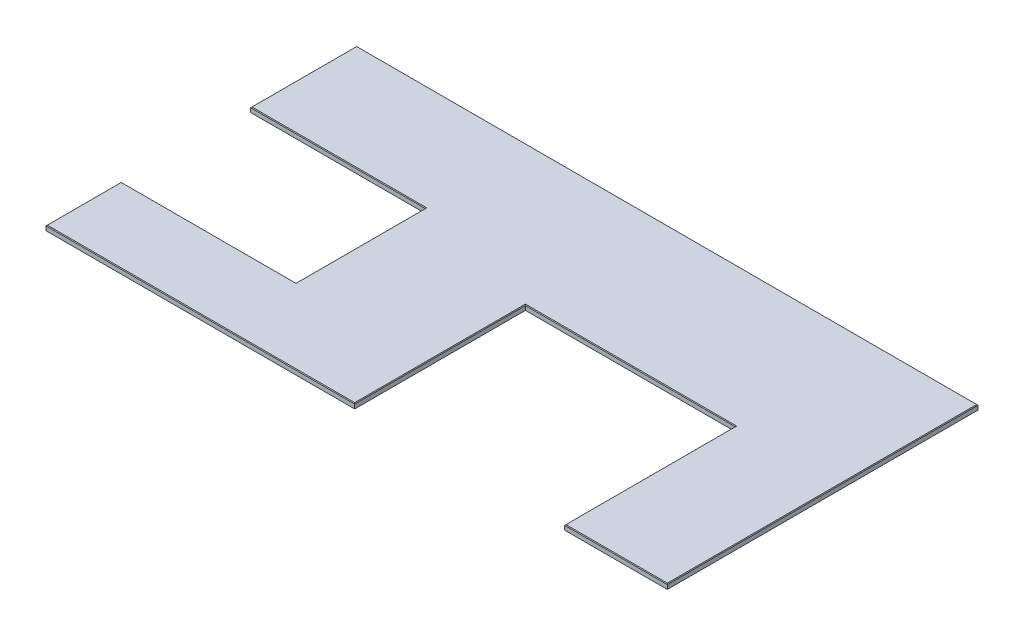
ISO-10303-21;
HEADER;
FILE_DESCRIPTION(('STEP AP214'),'2;1');
FILE_NAME('part.step','',(''),(''),'','','');
FILE_SCHEMA(('AUTOMOTIVE_DESIGN { 1 0 10303 214 1 1 1 1 }'));
ENDSEC;
DATA;
#1=APPLICATION_CONTEXT('core data for automotive mechanical design processes');
#2=APPLICATION_PROTOCOL_DEFINITION('international standard','automotive_design',2000,#1);
#3=PRODUCT_CONTEXT('',#1,'mechanical');
#4=PRODUCT('Part','Part','',(#3));
#5=PRODUCT_RELATED_PRODUCT_CATEGORY('part','',(#4));
#6=PRODUCT_DEFINITION_FORMATION('','',#4);
#7=PRODUCT_DEFINITION_CONTEXT('part definition',#1,'design');
#8=PRODUCT_DEFINITION('design','',#6,#7);
#9=PRODUCT_DEFINITION_SHAPE('','',#8);
#10=(LENGTH_UNIT() NAMED_UNIT(*) SI_UNIT(.MILLI.,.METRE.));
#11=(NAMED_UNIT(*) PLANE_ANGLE_UNIT() SI_UNIT($,.RADIAN.));
#12=(NAMED_UNIT(*) SI_UNIT($,.STERADIAN.) SOLID_ANGLE_UNIT());
#13=UNCERTAINTY_MEASURE_WITH_UNIT(LENGTH_MEASURE(1.E-05),#10,'distance_accuracy_value','');
#14=(GEOMETRIC_REPRESENTATION_CONTEXT(3) GLOBAL_UNCERTAINTY_ASSIGNED_CONTEXT((#13)) GLOBAL_UNIT_ASSIGNED_CONTEXT((#10,
#11,#12)) REPRESENTATION_CONTEXT('',''));
#15=CARTESIAN_POINT('',(0.,0.,0.));
#16=DIRECTION('',(0.,0.,1.));
#17=DIRECTION('',(1.,0.,0.));
#18=AXIS2_PLACEMENT_3D('',#15,#16,#17);
#19=CARTESIAN_POINT('',(0.,-19.05,0.));
#20=DIRECTION('',(0.,0.,1.));
#21=DIRECTION('',(1.,0.,0.));
#22=AXIS2_PLACEMENT_3D('',#19,#20,#21);
#23=PLANE('',#22);
#24=DIRECTION('',(0.,1.,0.));
#25=VECTOR('',#24,1.);
#26=CARTESIAN_POINT('',(1211.5165,-19.05,0.));
#27=LINE('',#26,#25);
#28=CARTESIAN_POINT('',(1211.5165,-19.05,0.));
#29=VERTEX_POINT('',#28);
#30=CARTESIAN_POINT('',(1211.5165,-2.53999999999999,0.));
#31=VERTEX_POINT('',#30);
#32=EDGE_CURVE('E166',#29,#31,#27,.T.);
#33=ORIENTED_EDGE('',*,*,#32,.T.);
#34=DIRECTION('',(-1.,0.,0.));
#35=VECTOR('',#34,1.);
#36=CARTESIAN_POINT('',(0.,-2.53999999999999,0.));
#37=LINE('',#36,#35);
#38=CARTESIAN_POINT('',(0.,-2.53999999999999,0.));
#39=VERTEX_POINT('',#38);
#40=EDGE_CURVE('E11',#31,#39,#37,.T.);
#41=ORIENTED_EDGE('',*,*,#40,.T.);
#42=DIRECTION('',(0.,1.,0.));
#43=VECTOR('',#42,1.);
#44=CARTESIAN_POINT('',(0.,-19.05,0.));
#45=LINE('',#44,#43);
#46=CARTESIAN_POINT('',(0.,-19.05,0.));
#47=VERTEX_POINT('',#46);
#48=EDGE_CURVE('E188',#47,#39,#45,.T.);
#49=ORIENTED_EDGE('',*,*,#48,.F.);
#50=DIRECTION('',(1.,0.,0.));
#51=VECTOR('',#50,1.);
#52=CARTESIAN_POINT('',(0.,-19.05,0.));
#53=LINE('',#52,#51);
#54=EDGE_CURVE('E181',#47,#29,#53,.T.);
#55=ORIENTED_EDGE('',*,*,#54,.T.);
#56=EDGE_LOOP('',(#33,#41,#49,#55));
#57=FACE_BOUND('',#56,.T.);
#58=ADVANCED_FACE('F41',(#57),#23,.T.);
#59=CARTESIAN_POINT('',(1.13148179390222E-13,-19.05,-295.275));
#60=DIRECTION('',(-1.,0.,0.));
#61=DIRECTION('',(0.,0.,1.));
#62=AXIS2_PLACEMENT_3D('',#59,#60,#61);
#63=PLANE('',#62);
#64=ORIENTED_EDGE('',*,*,#48,.T.);
#65=DIRECTION('',(0.,0.,-1.));
#66=VECTOR('',#65,1.);
#67=CARTESIAN_POINT('',(1.13148179390222E-13,-2.53999999999999,-295.275));
#68=LINE('',#67,#66);
#69=CARTESIAN_POINT('',(1.13148179390222E-13,-2.53999999999999,-295.275));
#70=VERTEX_POINT('',#69);
#71=EDGE_CURVE('E272',#39,#70,#68,.T.);
#72=ORIENTED_EDGE('',*,*,#71,.T.);
#73=DIRECTION('',(0.,1.,0.));
#74=VECTOR('',#73,1.);
#75=CARTESIAN_POINT('',(1.13148179390222E-13,-19.05,-295.275));
#76=LINE('',#75,#74);
#77=CARTESIAN_POINT('',(1.13148179390222E-13,-19.05,-295.275));
#78=VERTEX_POINT('',#77);
#79=EDGE_CURVE('E221',#78,#70,#76,.T.);
#80=ORIENTED_EDGE('',*,*,#79,.F.);
#81=DIRECTION('',(0.,0.,1.));
#82=VECTOR('',#81,1.);
#83=CARTESIAN_POINT('',(1.13148179390222E-13,-19.05,-295.275));
#84=LINE('',#83,#82);
#85=EDGE_CURVE('E174',#78,#47,#84,.T.);
#86=ORIENTED_EDGE('',*,*,#85,.T.);
#87=EDGE_LOOP('',(#64,#72,#80,#86));
#88=FACE_BOUND('',#87,.T.);
#89=ADVANCED_FACE('F354',(#88),#63,.T.);
#90=CARTESIAN_POINT('',(1.13148179390222E-13,-19.05,-295.275));
#91=DIRECTION('',(0.,0.,-1.));
#92=DIRECTION('',(-1.,0.,0.));
#93=AXIS2_PLACEMENT_3D('',#90,#91,#92);
#94=PLANE('',#93);
#95=ORIENTED_EDGE('',*,*,#79,.T.);
#96=DIRECTION('',(1.,0.,0.));
#97=VECTOR('',#96,1.);
#98=CARTESIAN_POINT('',(1.13148179390222E-13,-2.53999999999999,-295.275));
#99=LINE('',#98,#97);
#100=CARTESIAN_POINT('',(685.8,-2.53999999999999,-295.275));
#101=VERTEX_POINT('',#100);
#102=EDGE_CURVE('E275',#70,#101,#99,.T.);
#103=ORIENTED_EDGE('',*,*,#102,.T.);
#104=DIRECTION('',(0.,1.,0.));
#105=VECTOR('',#104,1.);
#106=CARTESIAN_POINT('',(685.8,-19.05,-295.275));
#107=LINE('',#106,#105);
#108=CARTESIAN_POINT('',(685.8,-19.05,-295.275));
#109=VERTEX_POINT('',#108);
#110=EDGE_CURVE('E224',#109,#101,#107,.T.);
#111=ORIENTED_EDGE('',*,*,#110,.F.);
#112=DIRECTION('',(-1.,0.,0.));
#113=VECTOR('',#112,1.);
#114=CARTESIAN_POINT('',(1.13148179390222E-13,-19.05,-295.275));
#115=LINE('',#114,#113);
#116=EDGE_CURVE('E215',#109,#78,#115,.T.);
#117=ORIENTED_EDGE('',*,*,#116,.T.);
#118=EDGE_LOOP('',(#95,#103,#111,#117));
#119=FACE_BOUND('',#118,.T.);
#120=ADVANCED_FACE('F365',(#119),#94,.T.);
#121=CARTESIAN_POINT('',(685.8,-19.05,-803.275));
#122=DIRECTION('',(-1.,0.,0.));
#123=DIRECTION('',(0.,0.,1.));
#124=AXIS2_PLACEMENT_3D('',#121,#122,#123);
#125=PLANE('',#124);
#126=ORIENTED_EDGE('',*,*,#110,.T.);
#127=DIRECTION('',(0.,0.,-1.));
#128=VECTOR('',#127,1.);
#129=CARTESIAN_POINT('',(685.8,-2.53999999999999,-803.275));
#130=LINE('',#129,#128);
#131=CARTESIAN_POINT('',(685.8,-2.53999999999999,-803.275));
#132=VERTEX_POINT('',#131);
#133=EDGE_CURVE('E277',#101,#132,#130,.T.);
#134=ORIENTED_EDGE('',*,*,#133,.T.);
#135=DIRECTION('',(0.,1.,0.));
#136=VECTOR('',#135,1.);
#137=CARTESIAN_POINT('',(685.8,-19.05,-803.275));
#138=LINE('',#137,#136);
#139=CARTESIAN_POINT('',(685.8,-19.05,-803.275));
#140=VERTEX_POINT('',#139);
#141=EDGE_CURVE('E227',#140,#132,#138,.T.);
#142=ORIENTED_EDGE('',*,*,#141,.F.);
#143=DIRECTION('',(0.,0.,1.));
#144=VECTOR('',#143,1.);
#145=CARTESIAN_POINT('',(685.8,-19.05,-803.275));
#146=LINE('',#145,#144);
#147=EDGE_CURVE('E212',#140,#109,#146,.T.);
#148=ORIENTED_EDGE('',*,*,#147,.T.);
#149=EDGE_LOOP('',(#126,#134,#142,#148));
#150=FACE_BOUND('',#149,.T.);
#151=ADVANCED_FACE('F369',(#150),#125,.T.);
#152=CARTESIAN_POINT('',(0.,-19.05,-803.275));
#153=DIRECTION('',(0.,0.,1.));
#154=DIRECTION('',(1.,0.,0.));
#155=AXIS2_PLACEMENT_3D('',#152,#153,#154);
#156=PLANE('',#155);
#157=ORIENTED_EDGE('',*,*,#141,.T.);
#158=DIRECTION('',(-1.,0.,0.));
#159=VECTOR('',#158,1.);
#160=CARTESIAN_POINT('',(0.,-2.53999999999999,-803.275));
#161=LINE('',#160,#159);
#162=CARTESIAN_POINT('',(0.,-2.53999999999999,-803.275));
#163=VERTEX_POINT('',#162);
#164=EDGE_CURVE('E279',#132,#163,#161,.T.);
#165=ORIENTED_EDGE('',*,*,#164,.T.);
#166=DIRECTION('',(0.,1.,0.));
#167=VECTOR('',#166,1.);
#168=CARTESIAN_POINT('',(0.,-19.05,-803.275));
#169=LINE('',#168,#167);
#170=CARTESIAN_POINT('',(0.,-19.05,-803.275));
#171=VERTEX_POINT('',#170);
#172=EDGE_CURVE('E230',#171,#163,#169,.T.);
#173=ORIENTED_EDGE('',*,*,#172,.F.);
#174=DIRECTION('',(1.,0.,0.));
#175=VECTOR('',#174,1.);
#176=CARTESIAN_POINT('',(0.,-19.05,-803.275));
#177=LINE('',#176,#175);
#178=EDGE_CURVE('E209',#171,#140,#177,.T.);
#179=ORIENTED_EDGE('',*,*,#178,.T.);
#180=EDGE_LOOP('',(#157,#165,#173,#179));
#181=FACE_BOUND('',#180,.T.);
#182=ADVANCED_FACE('F381',(#181),#156,.T.);
#183=CARTESIAN_POINT('',(-2.29534139493609E-13,-19.05,-1219.2));
#184=DIRECTION('',(-1.,0.,0.));
#185=DIRECTION('',(0.,0.,1.));
#186=AXIS2_PLACEMENT_3D('',#183,#184,#185);
#187=PLANE('',#186);
#188=ORIENTED_EDGE('',*,*,#172,.T.);
#189=DIRECTION('',(0.,0.,-1.));
#190=VECTOR('',#189,1.);
#191=CARTESIAN_POINT('',(-2.29534139493609E-13,-2.53999999999999,-1219.2));
#192=LINE('',#191,#190);
#193=CARTESIAN_POINT('',(-2.29534139493609E-13,-2.53999999999999,-1219.2));
#194=VERTEX_POINT('',#193);
#195=EDGE_CURVE('E281',#163,#194,#192,.T.);
#196=ORIENTED_EDGE('',*,*,#195,.T.);
#197=DIRECTION('',(0.,1.,0.));
#198=VECTOR('',#197,1.);
#199=CARTESIAN_POINT('',(-2.29534139493609E-13,-19.05,-1219.2));
#200=LINE('',#199,#198);
#201=CARTESIAN_POINT('',(-2.29534139493609E-13,-19.05,-1219.2));
#202=VERTEX_POINT('',#201);
#203=EDGE_CURVE('E233',#202,#194,#200,.T.);
#204=ORIENTED_EDGE('',*,*,#203,.F.);
#205=DIRECTION('',(0.,0.,1.));
#206=VECTOR('',#205,1.);
#207=CARTESIAN_POINT('',(-2.29534139493609E-13,-19.05,-1219.2));
#208=LINE('',#207,#206);
#209=EDGE_CURVE('E206',#202,#171,#208,.T.);
#210=ORIENTED_EDGE('',*,*,#209,.T.);
#211=EDGE_LOOP('',(#188,#196,#204,#210));
#212=FACE_BOUND('',#211,.T.);
#213=ADVANCED_FACE('F385',(#212),#187,.T.);
#214=CARTESIAN_POINT('',(2438.4,-19.05,-1219.2));
#215=DIRECTION('',(0.,0.,-1.));
#216=DIRECTION('',(-1.,0.,0.));
#217=AXIS2_PLACEMENT_3D('',#214,#215,#216);
#218=PLANE('',#217);
#219=ORIENTED_EDGE('',*,*,#203,.T.);
#220=DIRECTION('',(1.,0.,0.));
#221=VECTOR('',#220,1.);
#222=CARTESIAN_POINT('',(2438.4,-2.53999999999999,-1219.2));
#223=LINE('',#222,#221);
#224=CARTESIAN_POINT('',(2438.4,-2.53999999999999,-1219.2));
#225=VERTEX_POINT('',#224);
#226=EDGE_CURVE('E283',#194,#225,#223,.T.);
#227=ORIENTED_EDGE('',*,*,#226,.T.);
#228=DIRECTION('',(0.,1.,0.));
#229=VECTOR('',#228,1.);
#230=CARTESIAN_POINT('',(2438.4,-19.05,-1219.2));
#231=LINE('',#230,#229);
#232=CARTESIAN_POINT('',(2438.4,-19.05,-1219.2));
#233=VERTEX_POINT('',#232);
#234=EDGE_CURVE('E236',#233,#225,#231,.T.);
#235=ORIENTED_EDGE('',*,*,#234,.F.);
#236=DIRECTION('',(-1.,0.,0.));
#237=VECTOR('',#236,1.);
#238=CARTESIAN_POINT('',(2438.4,-19.05,-1219.2));
#239=LINE('',#238,#237);
#240=EDGE_CURVE('E203',#233,#202,#239,.T.);
#241=ORIENTED_EDGE('',*,*,#240,.T.);
#242=EDGE_LOOP('',(#219,#227,#235,#241));
#243=FACE_BOUND('',#242,.T.);
#244=ADVANCED_FACE('F394',(#243),#218,.T.);
#245=CARTESIAN_POINT('',(2438.4,-19.05,0.));
#246=DIRECTION('',(1.,0.,0.));
#247=DIRECTION('',(0.,0.,-1.));
#248=AXIS2_PLACEMENT_3D('',#245,#246,#247);
#249=PLANE('',#248);
#250=ORIENTED_EDGE('',*,*,#234,.T.);
#251=DIRECTION('',(0.,0.,1.));
#252=VECTOR('',#251,1.);
#253=CARTESIAN_POINT('',(2438.4,-2.53999999999999,0.));
#254=LINE('',#253,#252);
#255=CARTESIAN_POINT('',(2438.4,-2.53999999999999,0.));
#256=VERTEX_POINT('',#255);
#257=EDGE_CURVE('E285',#225,#256,#254,.T.);
#258=ORIENTED_EDGE('',*,*,#257,.T.);
#259=DIRECTION('',(0.,1.,0.));
#260=VECTOR('',#259,1.);
#261=CARTESIAN_POINT('',(2438.4,-19.05,0.));
#262=LINE('',#261,#260);
#263=CARTESIAN_POINT('',(2438.4,-19.05,0.));
#264=VERTEX_POINT('',#263);
#265=EDGE_CURVE('E239',#264,#256,#262,.T.);
#266=ORIENTED_EDGE('',*,*,#265,.F.);
#267=DIRECTION('',(0.,0.,-1.));
#268=VECTOR('',#267,1.);
#269=CARTESIAN_POINT('',(2438.4,-19.05,0.));
#270=LINE('',#269,#268);
#271=EDGE_CURVE('E200',#264,#233,#270,.T.);
#272=ORIENTED_EDGE('',*,*,#271,.T.);
#273=EDGE_LOOP('',(#250,#258,#266,#272));
#274=FACE_BOUND('',#273,.T.);
#275=ADVANCED_FACE('F397',(#274),#249,.T.);
#276=CARTESIAN_POINT('',(2035.429,-19.05,0.));
#277=DIRECTION('',(0.,0.,1.));
#278=DIRECTION('',(1.,0.,0.));
#279=AXIS2_PLACEMENT_3D('',#276,#277,#278);
#280=PLANE('',#279);
#281=ORIENTED_EDGE('',*,*,#265,.T.);
#282=DIRECTION('',(-1.,0.,0.));
#283=VECTOR('',#282,1.);
#284=CARTESIAN_POINT('',(2035.429,-2.53999999999999,0.));
#285=LINE('',#284,#283);
#286=CARTESIAN_POINT('',(2035.429,-2.53999999999999,0.));
#287=VERTEX_POINT('',#286);
#288=EDGE_CURVE('E287',#256,#287,#285,.T.);
#289=ORIENTED_EDGE('',*,*,#288,.T.);
#290=DIRECTION('',(0.,1.,0.));
#291=VECTOR('',#290,1.);
#292=CARTESIAN_POINT('',(2035.429,-19.05,0.));
#293=LINE('',#292,#291);
#294=CARTESIAN_POINT('',(2035.429,-19.05,0.));
#295=VERTEX_POINT('',#294);
#296=EDGE_CURVE('E242',#295,#287,#293,.T.);
#297=ORIENTED_EDGE('',*,*,#296,.F.);
#298=DIRECTION('',(1.,0.,0.));
#299=VECTOR('',#298,1.);
#300=CARTESIAN_POINT('',(2035.429,-19.05,0.));
#301=LINE('',#300,#299);
#302=EDGE_CURVE('E197',#295,#264,#301,.T.);
#303=ORIENTED_EDGE('',*,*,#302,.T.);
#304=EDGE_LOOP('',(#281,#289,#297,#303));
#305=FACE_BOUND('',#304,.T.);
#306=ADVANCED_FACE('F401',(#305),#280,.T.);
#307=CARTESIAN_POINT('',(2035.429,-19.05,-669.925));
#308=DIRECTION('',(-1.,0.,0.));
#309=DIRECTION('',(0.,0.,1.));
#310=AXIS2_PLACEMENT_3D('',#307,#308,#309);
#311=PLANE('',#310);
#312=ORIENTED_EDGE('',*,*,#296,.T.);
#313=DIRECTION('',(0.,0.,-1.));
#314=VECTOR('',#313,1.);
#315=CARTESIAN_POINT('',(2035.429,-2.53999999999999,-669.925));
#316=LINE('',#315,#314);
#317=CARTESIAN_POINT('',(2035.429,-2.53999999999999,-669.925));
#318=VERTEX_POINT('',#317);
#319=EDGE_CURVE('E289',#287,#318,#316,.T.);
#320=ORIENTED_EDGE('',*,*,#319,.T.);
#321=DIRECTION('',(0.,1.,0.));
#322=VECTOR('',#321,1.);
#323=CARTESIAN_POINT('',(2035.429,-19.05,-669.925));
#324=LINE('',#323,#322);
#325=CARTESIAN_POINT('',(2035.429,-19.05,-669.925));
#326=VERTEX_POINT('',#325);
#327=EDGE_CURVE('E245',#326,#318,#324,.T.);
#328=ORIENTED_EDGE('',*,*,#327,.F.);
#329=DIRECTION('',(0.,0.,1.));
#330=VECTOR('',#329,1.);
#331=CARTESIAN_POINT('',(2035.429,-19.05,-669.925));
#332=LINE('',#331,#330);
#333=EDGE_CURVE('E194',#326,#295,#332,.T.);
#334=ORIENTED_EDGE('',*,*,#333,.T.);
#335=EDGE_LOOP('',(#312,#320,#328,#334));
#336=FACE_BOUND('',#335,.T.);
#337=ADVANCED_FACE('F403',(#336),#311,.T.);
#338=CARTESIAN_POINT('',(1211.5165,-19.05,-669.925));
#339=DIRECTION('',(0.,0.,1.));
#340=DIRECTION('',(1.,0.,0.));
#341=AXIS2_PLACEMENT_3D('',#338,#339,#340);
#342=PLANE('',#341);
#343=ORIENTED_EDGE('',*,*,#327,.T.);
#344=DIRECTION('',(-1.,0.,0.));
#345=VECTOR('',#344,1.);
#346=CARTESIAN_POINT('',(1211.5165,-2.53999999999999,-669.925));
#347=LINE('',#346,#345);
#348=CARTESIAN_POINT('',(1211.5165,-2.53999999999999,-669.925));
#349=VERTEX_POINT('',#348);
#350=EDGE_CURVE('E66',#318,#349,#347,.T.);
#351=ORIENTED_EDGE('',*,*,#350,.T.);
#352=DIRECTION('',(0.,1.,0.));
#353=VECTOR('',#352,1.);
#354=CARTESIAN_POINT('',(1211.5165,-19.05,-669.925));
#355=LINE('',#354,#353);
#356=CARTESIAN_POINT('',(1211.5165,-19.05,-669.925));
#357=VERTEX_POINT('',#356);
#358=EDGE_CURVE('E173',#357,#349,#355,.T.);
#359=ORIENTED_EDGE('',*,*,#358,.F.);
#360=DIRECTION('',(1.,0.,0.));
#361=VECTOR('',#360,1.);
#362=CARTESIAN_POINT('',(1211.5165,-19.05,-669.925));
#363=LINE('',#362,#361);
#364=EDGE_CURVE('E185',#357,#326,#363,.T.);
#365=ORIENTED_EDGE('',*,*,#364,.T.);
#366=EDGE_LOOP('',(#343,#351,#359,#365));
#367=FACE_BOUND('',#366,.T.);
#368=ADVANCED_FACE('F404',(#367),#342,.T.);
#369=CARTESIAN_POINT('',(1211.5165,-19.05,0.));
#370=DIRECTION('',(1.,0.,0.));
#371=DIRECTION('',(0.,0.,-1.));
#372=AXIS2_PLACEMENT_3D('',#369,#370,#371);
#373=PLANE('',#372);
#374=ORIENTED_EDGE('',*,*,#358,.T.);
#375=DIRECTION('',(0.,0.,1.));
#376=VECTOR('',#375,1.);
#377=CARTESIAN_POINT('',(1211.5165,-2.53999999999999,0.));
#378=LINE('',#377,#376);
#379=EDGE_CURVE('E51',#349,#31,#378,.T.);
#380=ORIENTED_EDGE('',*,*,#379,.T.);
#381=ORIENTED_EDGE('',*,*,#32,.F.);
#382=DIRECTION('',(0.,0.,-1.));
#383=VECTOR('',#382,1.);
#384=CARTESIAN_POINT('',(1211.5165,-19.05,0.));
#385=LINE('',#384,#383);
#386=EDGE_CURVE('E169',#29,#357,#385,.T.);
#387=ORIENTED_EDGE('',*,*,#386,.T.);
#388=EDGE_LOOP('',(#374,#380,#381,#387));
#389=FACE_BOUND('',#388,.T.);
#390=ADVANCED_FACE('F168',(#389),#373,.T.);
#391=CARTESIAN_POINT('',(0.,-19.05,0.));
#392=DIRECTION('',(0.,1.,0.));
#393=DIRECTION('',(0.,0.,1.));
#394=AXIS2_PLACEMENT_3D('',#391,#392,#393);
#395=PLANE('',#394);
#396=ORIENTED_EDGE('',*,*,#54,.F.);
#397=ORIENTED_EDGE('',*,*,#85,.F.);
#398=ORIENTED_EDGE('',*,*,#116,.F.);
#399=ORIENTED_EDGE('',*,*,#147,.F.);
#400=ORIENTED_EDGE('',*,*,#178,.F.);
#401=ORIENTED_EDGE('',*,*,#209,.F.);
#402=ORIENTED_EDGE('',*,*,#240,.F.);
#403=ORIENTED_EDGE('',*,*,#271,.F.);
#404=ORIENTED_EDGE('',*,*,#302,.F.);
#405=ORIENTED_EDGE('',*,*,#333,.F.);
#406=ORIENTED_EDGE('',*,*,#364,.F.);
#407=ORIENTED_EDGE('',*,*,#386,.F.);
#408=EDGE_LOOP('',(#396,#397,#398,#399,#400,#401,#402,#403,#404,#405,#406,#407));
#409=FACE_BOUND('',#408,.T.);
#410=ADVANCED_FACE('F179',(#409),#395,.F.);
#411=CARTESIAN_POINT('',(0.,0.,0.));
#412=DIRECTION('',(0.,1.,0.));
#413=DIRECTION('',(0.,0.,1.));
#414=AXIS2_PLACEMENT_3D('',#411,#412,#413);
#415=PLANE('',#414);
#416=DIRECTION('',(-1.,0.,0.));
#417=VECTOR('',#416,1.);
#418=CARTESIAN_POINT('',(0.,0.,-292.735));
#419=LINE('',#418,#417);
#420=CARTESIAN_POINT('',(688.34,0.,-292.735));
#421=VERTEX_POINT('',#420);
#422=CARTESIAN_POINT('',(2.5400000000001,0.,-292.735));
#423=VERTEX_POINT('',#422);
#424=EDGE_CURVE('E267',#421,#423,#419,.T.);
#425=ORIENTED_EDGE('',*,*,#424,.T.);
#426=DIRECTION('',(0.,0.,1.));
#427=VECTOR('',#426,1.);
#428=CARTESIAN_POINT('',(2.53999999999999,0.,0.));
#429=LINE('',#428,#427);
#430=CARTESIAN_POINT('',(2.53999999999999,0.,-2.53999999999999));
#431=VERTEX_POINT('',#430);
#432=EDGE_CURVE('E269',#423,#431,#429,.T.);
#433=ORIENTED_EDGE('',*,*,#432,.T.);
#434=DIRECTION('',(1.,0.,0.));
#435=VECTOR('',#434,1.);
#436=CARTESIAN_POINT('',(0.,0.,-2.53999999999999));
#437=LINE('',#436,#435);
#438=CARTESIAN_POINT('',(1208.9765,0.,-2.53999999999999));
#439=VERTEX_POINT('',#438);
#440=EDGE_CURVE('E220',#431,#439,#437,.T.);
#441=ORIENTED_EDGE('',*,*,#440,.T.);
#442=DIRECTION('',(0.,0.,-1.));
#443=VECTOR('',#442,1.);
#444=CARTESIAN_POINT('',(1208.9765,0.,0.));
#445=LINE('',#444,#443);
#446=CARTESIAN_POINT('',(1208.9765,0.,-672.465));
#447=VERTEX_POINT('',#446);
#448=EDGE_CURVE('E249',#439,#447,#445,.T.);
#449=ORIENTED_EDGE('',*,*,#448,.T.);
#450=DIRECTION('',(1.,0.,0.));
#451=VECTOR('',#450,1.);
#452=CARTESIAN_POINT('',(0.,0.,-672.465));
#453=LINE('',#452,#451);
#454=CARTESIAN_POINT('',(2037.969,0.,-672.465));
#455=VERTEX_POINT('',#454);
#456=EDGE_CURVE('E251',#447,#455,#453,.T.);
#457=ORIENTED_EDGE('',*,*,#456,.T.);
#458=DIRECTION('',(0.,0.,1.));
#459=VECTOR('',#458,1.);
#460=CARTESIAN_POINT('',(2037.969,0.,0.));
#461=LINE('',#460,#459);
#462=CARTESIAN_POINT('',(2037.969,0.,-2.53999999999999));
#463=VERTEX_POINT('',#462);
#464=EDGE_CURVE('E253',#455,#463,#461,.T.);
#465=ORIENTED_EDGE('',*,*,#464,.T.);
#466=DIRECTION('',(1.,0.,0.));
#467=VECTOR('',#466,1.);
#468=CARTESIAN_POINT('',(0.,0.,-2.53999999999999));
#469=LINE('',#468,#467);
#470=CARTESIAN_POINT('',(2435.86,0.,-2.53999999999999));
#471=VERTEX_POINT('',#470);
#472=EDGE_CURVE('E255',#463,#471,#469,.T.);
#473=ORIENTED_EDGE('',*,*,#472,.T.);
#474=DIRECTION('',(0.,0.,-1.));
#475=VECTOR('',#474,1.);
#476=CARTESIAN_POINT('',(2435.86,0.,0.));
#477=LINE('',#476,#475);
#478=CARTESIAN_POINT('',(2435.86,0.,-1216.66));
#479=VERTEX_POINT('',#478);
#480=EDGE_CURVE('E257',#471,#479,#477,.T.);
#481=ORIENTED_EDGE('',*,*,#480,.T.);
#482=DIRECTION('',(-1.,0.,0.));
#483=VECTOR('',#482,1.);
#484=CARTESIAN_POINT('',(0.,0.,-1216.66));
#485=LINE('',#484,#483);
#486=CARTESIAN_POINT('',(2.53999999999976,0.,-1216.66));
#487=VERTEX_POINT('',#486);
#488=EDGE_CURVE('E259',#479,#487,#485,.T.);
#489=ORIENTED_EDGE('',*,*,#488,.T.);
#490=DIRECTION('',(0.,0.,1.));
#491=VECTOR('',#490,1.);
#492=CARTESIAN_POINT('',(2.54000000000058,0.,0.));
#493=LINE('',#492,#491);
#494=CARTESIAN_POINT('',(2.54000000000004,0.,-805.815));
#495=VERTEX_POINT('',#494);
#496=EDGE_CURVE('E261',#487,#495,#493,.T.);
#497=ORIENTED_EDGE('',*,*,#496,.T.);
#498=DIRECTION('',(1.,0.,0.));
#499=VECTOR('',#498,1.);
#500=CARTESIAN_POINT('',(0.,0.,-805.815));
#501=LINE('',#500,#499);
#502=CARTESIAN_POINT('',(688.34,0.,-805.815));
#503=VERTEX_POINT('',#502);
#504=EDGE_CURVE('E263',#495,#503,#501,.T.);
#505=ORIENTED_EDGE('',*,*,#504,.T.);
#506=DIRECTION('',(0.,0.,1.));
#507=VECTOR('',#506,1.);
#508=CARTESIAN_POINT('',(688.34,0.,-1.50435219836709E-13));
#509=LINE('',#508,#507);
#510=EDGE_CURVE('E265',#503,#421,#509,.T.);
#511=ORIENTED_EDGE('',*,*,#510,.T.);
#512=EDGE_LOOP('',(#425,#433,#441,#449,#457,#465,#473,#481,#489,#497,#505,#511));
#513=FACE_BOUND('',#512,.T.);
#514=ADVANCED_FACE('F333',(#513),#415,.T.);
#515=CARTESIAN_POINT('',(2435.86,0.,0.));
#516=DIRECTION('',(-0.707106781186578,-0.707106781186517,0.));
#517=DIRECTION('',(0.,0.,-1.));
#518=AXIS2_PLACEMENT_3D('',#515,#516,#517);
#519=PLANE('',#518);
#520=DIRECTION('',(-0.577350269189592,0.577350269189642,-0.577350269189642));
#521=VECTOR('',#520,1.);
#522=CARTESIAN_POINT('',(1623.90666666676,811.95333333331,-814.49333333331));
#523=LINE('',#522,#521);
#524=EDGE_CURVE('E191',#256,#471,#523,.T.);
#525=ORIENTED_EDGE('',*,*,#524,.F.);
#526=ORIENTED_EDGE('',*,*,#257,.F.);
#527=DIRECTION('',(-0.577350269189592,0.577350269189642,0.577350269189642));
#528=VECTOR('',#527,1.);
#529=CARTESIAN_POINT('',(2030.30666666668,405.553333333357,-811.106666666643));
#530=LINE('',#529,#528);
#531=EDGE_CURVE('E46',#479,#225,#530,.F.);
#532=ORIENTED_EDGE('',*,*,#531,.F.);
#533=ORIENTED_EDGE('',*,*,#480,.F.);
#534=EDGE_LOOP('',(#525,#526,#532,#533));
#535=FACE_BOUND('',#534,.T.);
#536=ADVANCED_FACE('F44',(#535),#519,.F.);
#537=CARTESIAN_POINT('',(0.,0.,-1216.66));
#538=DIRECTION('',(0.,-0.707106781186548,0.707106781186548));
#539=DIRECTION('',(-1.,0.,0.));
#540=AXIS2_PLACEMENT_3D('',#537,#538,#539);
#541=PLANE('',#540);
#542=ORIENTED_EDGE('',*,*,#531,.T.);
#543=ORIENTED_EDGE('',*,*,#226,.F.);
#544=DIRECTION('',(0.577350269189626,0.577350269189626,0.577350269189626));
#545=VECTOR('',#544,1.);
#546=CARTESIAN_POINT('',(1.69333333333317,-0.846666666666586,-1217.50666666667));
#547=LINE('',#546,#545);
#548=EDGE_CURVE('E318',#487,#194,#547,.F.);
#549=ORIENTED_EDGE('',*,*,#548,.F.);
#550=ORIENTED_EDGE('',*,*,#488,.F.);
#551=EDGE_LOOP('',(#542,#543,#549,#550));
#552=FACE_BOUND('',#551,.T.);
#553=ADVANCED_FACE('F392',(#552),#541,.F.);
#554=CARTESIAN_POINT('',(0.,0.,-2.53999999999999));
#555=DIRECTION('',(0.,-0.707106781186548,-0.707106781186548));
#556=DIRECTION('',(1.,0.,0.));
#557=AXIS2_PLACEMENT_3D('',#554,#555,#556);
#558=PLANE('',#557);
#559=ORIENTED_EDGE('',*,*,#524,.T.);
#560=ORIENTED_EDGE('',*,*,#472,.F.);
#561=DIRECTION('',(0.577350269189592,0.577350269189642,-0.577350269189642));
#562=VECTOR('',#561,1.);
#563=CARTESIAN_POINT('',(2037.12233333333,-0.846666666666711,-1.69333333333327));
#564=LINE('',#563,#562);
#565=EDGE_CURVE('E315',#287,#463,#564,.T.);
#566=ORIENTED_EDGE('',*,*,#565,.F.);
#567=ORIENTED_EDGE('',*,*,#288,.F.);
#568=EDGE_LOOP('',(#559,#560,#566,#567));
#569=FACE_BOUND('',#568,.T.);
#570=ADVANCED_FACE('F325',(#569),#558,.F.);
#571=CARTESIAN_POINT('',(2.54000000000058,0.,0.));
#572=DIRECTION('',(0.707106781186548,-0.707106781186548,0.));
#573=DIRECTION('',(0.,0.,1.));
#574=AXIS2_PLACEMENT_3D('',#571,#572,#573);
#575=PLANE('',#574);
#576=ORIENTED_EDGE('',*,*,#548,.T.);
#577=ORIENTED_EDGE('',*,*,#195,.F.);
#578=DIRECTION('',(0.577350269189626,0.577350269189626,-0.577350269189626));
#579=VECTOR('',#578,1.);
#580=CARTESIAN_POINT('',(-266.065,-268.605,-537.21));
#581=LINE('',#580,#579);
#582=EDGE_CURVE('E312',#495,#163,#581,.F.);
#583=ORIENTED_EDGE('',*,*,#582,.F.);
#584=ORIENTED_EDGE('',*,*,#496,.F.);
#585=EDGE_LOOP('',(#576,#577,#583,#584));
#586=FACE_BOUND('',#585,.T.);
#587=ADVANCED_FACE('F388',(#586),#575,.F.);
#588=CARTESIAN_POINT('',(2037.969,0.,0.));
#589=DIRECTION('',(0.707106781186578,-0.707106781186517,0.));
#590=DIRECTION('',(0.,0.,1.));
#591=AXIS2_PLACEMENT_3D('',#588,#589,#590);
#592=PLANE('',#591);
#593=ORIENTED_EDGE('',*,*,#565,.T.);
#594=ORIENTED_EDGE('',*,*,#464,.F.);
#595=DIRECTION('',(0.577350269189592,0.577350269189642,-0.577350269189642));
#596=VECTOR('',#595,1.);
#597=CARTESIAN_POINT('',(1813.81400000001,-224.155000000013,-448.309999999987));
#598=LINE('',#597,#596);
#599=EDGE_CURVE('E309',#318,#455,#598,.T.);
#600=ORIENTED_EDGE('',*,*,#599,.F.);
#601=ORIENTED_EDGE('',*,*,#319,.F.);
#602=EDGE_LOOP('',(#593,#594,#600,#601));
#603=FACE_BOUND('',#602,.T.);
#604=ADVANCED_FACE('F339',(#603),#592,.F.);
#605=CARTESIAN_POINT('',(0.,0.,-805.815));
#606=DIRECTION('',(0.,-0.707106781186548,-0.707106781186548));
#607=DIRECTION('',(1.,0.,0.));
#608=AXIS2_PLACEMENT_3D('',#605,#606,#607);
#609=PLANE('',#608);
#610=ORIENTED_EDGE('',*,*,#582,.T.);
#611=ORIENTED_EDGE('',*,*,#164,.F.);
#612=DIRECTION('',(0.577350269189633,0.577350269189622,-0.577350269189622));
#613=VECTOR('',#612,1.);
#614=CARTESIAN_POINT('',(419.734999999999,-268.604999999997,-537.210000000003));
#615=LINE('',#614,#613);
#616=EDGE_CURVE('E306',#503,#132,#615,.F.);
#617=ORIENTED_EDGE('',*,*,#616,.F.);
#618=ORIENTED_EDGE('',*,*,#504,.F.);
#619=EDGE_LOOP('',(#610,#611,#617,#618));
#620=FACE_BOUND('',#619,.T.);
#621=ADVANCED_FACE('F378',(#620),#609,.F.);
#622=CARTESIAN_POINT('',(0.,0.,-672.465));
#623=DIRECTION('',(0.,-0.707106781186548,-0.707106781186548));
#624=DIRECTION('',(1.,0.,0.));
#625=AXIS2_PLACEMENT_3D('',#622,#623,#624);
#626=PLANE('',#625);
#627=ORIENTED_EDGE('',*,*,#599,.T.);
#628=ORIENTED_EDGE('',*,*,#456,.F.);
#629=DIRECTION('',(-0.577350269189626,0.577350269189626,-0.577350269189626));
#630=VECTOR('',#629,1.);
#631=CARTESIAN_POINT('',(805.984333333333,402.992166666667,-1075.45716666667));
#632=LINE('',#631,#630);
#633=EDGE_CURVE('E303',#349,#447,#632,.T.);
#634=ORIENTED_EDGE('',*,*,#633,.F.);
#635=ORIENTED_EDGE('',*,*,#350,.F.);
#636=EDGE_LOOP('',(#627,#628,#634,#635));
#637=FACE_BOUND('',#636,.T.);
#638=ADVANCED_FACE('F342',(#637),#626,.F.);
#639=CARTESIAN_POINT('',(688.34,0.,-1.50435219836709E-13));
#640=DIRECTION('',(0.707106781186541,-0.707106781186554,0.));
#641=DIRECTION('',(0.,0.,1.));
#642=AXIS2_PLACEMENT_3D('',#639,#640,#641);
#643=PLANE('',#642);
#644=ORIENTED_EDGE('',*,*,#616,.T.);
#645=ORIENTED_EDGE('',*,*,#133,.F.);
#646=DIRECTION('',(0.577350269189633,0.577350269189622,0.577350269189622));
#647=VECTOR('',#646,1.);
#648=CARTESIAN_POINT('',(458.893333333328,-229.446666666668,-522.181666666668));
#649=LINE('',#648,#647);
#650=EDGE_CURVE('E300',#421,#101,#649,.F.);
#651=ORIENTED_EDGE('',*,*,#650,.F.);
#652=ORIENTED_EDGE('',*,*,#510,.F.);
#653=EDGE_LOOP('',(#644,#645,#651,#652));
#654=FACE_BOUND('',#653,.T.);
#655=ADVANCED_FACE('F372',(#654),#643,.F.);
#656=CARTESIAN_POINT('',(1208.9765,0.,0.));
#657=DIRECTION('',(-0.707106781186548,-0.707106781186548,0.));
#658=DIRECTION('',(0.,0.,-1.));
#659=AXIS2_PLACEMENT_3D('',#656,#657,#658);
#660=PLANE('',#659);
#661=ORIENTED_EDGE('',*,*,#633,.T.);
#662=ORIENTED_EDGE('',*,*,#448,.F.);
#663=DIRECTION('',(-0.577350269189626,0.577350269189626,-0.577350269189626));
#664=VECTOR('',#663,1.);
#665=CARTESIAN_POINT('',(805.984333333333,402.992166666667,-405.532166666667));
#666=LINE('',#665,#664);
#667=EDGE_CURVE('E297',#31,#439,#666,.T.);
#668=ORIENTED_EDGE('',*,*,#667,.F.);
#669=ORIENTED_EDGE('',*,*,#379,.F.);
#670=EDGE_LOOP('',(#661,#662,#668,#669));
#671=FACE_BOUND('',#670,.T.);
#672=ADVANCED_FACE('F346',(#671),#660,.F.);
#673=CARTESIAN_POINT('',(0.,0.,-292.735));
#674=DIRECTION('',(0.,-0.707106781186548,0.707106781186548));
#675=DIRECTION('',(-1.,0.,0.));
#676=AXIS2_PLACEMENT_3D('',#673,#674,#675);
#677=PLANE('',#676);
#678=ORIENTED_EDGE('',*,*,#650,.T.);
#679=ORIENTED_EDGE('',*,*,#102,.F.);
#680=DIRECTION('',(0.577350269189626,0.577350269189626,0.577350269189626));
#681=VECTOR('',#680,1.);
#682=CARTESIAN_POINT('',(1.69333333333341,-0.846666666666692,-293.581666666667));
#683=LINE('',#682,#681);
#684=EDGE_CURVE('E295',#423,#70,#683,.F.);
#685=ORIENTED_EDGE('',*,*,#684,.F.);
#686=ORIENTED_EDGE('',*,*,#424,.F.);
#687=EDGE_LOOP('',(#678,#679,#685,#686));
#688=FACE_BOUND('',#687,.T.);
#689=ADVANCED_FACE('F362',(#688),#677,.F.);
#690=CARTESIAN_POINT('',(0.,0.,-2.53999999999999));
#691=DIRECTION('',(0.,-0.707106781186548,-0.707106781186548));
#692=DIRECTION('',(1.,0.,0.));
#693=AXIS2_PLACEMENT_3D('',#690,#691,#692);
#694=PLANE('',#693);
#695=ORIENTED_EDGE('',*,*,#667,.T.);
#696=ORIENTED_EDGE('',*,*,#440,.F.);
#697=DIRECTION('',(-0.577350269189626,-0.577350269189626,0.577350269189626));
#698=VECTOR('',#697,1.);
#699=CARTESIAN_POINT('',(1.69333333333332,-0.846666666666663,-1.69333333333332));
#700=LINE('',#699,#698);
#701=EDGE_CURVE('E293',#39,#431,#700,.F.);
#702=ORIENTED_EDGE('',*,*,#701,.F.);
#703=ORIENTED_EDGE('',*,*,#40,.F.);
#704=EDGE_LOOP('',(#695,#696,#702,#703));
#705=FACE_BOUND('',#704,.T.);
#706=ADVANCED_FACE('F351',(#705),#694,.F.);
#707=CARTESIAN_POINT('',(2.53999999999999,0.,0.));
#708=DIRECTION('',(0.707106781186548,-0.707106781186548,0.));
#709=DIRECTION('',(0.,0.,1.));
#710=AXIS2_PLACEMENT_3D('',#707,#708,#709);
#711=PLANE('',#710);
#712=ORIENTED_EDGE('',*,*,#684,.T.);
#713=ORIENTED_EDGE('',*,*,#71,.F.);
#714=ORIENTED_EDGE('',*,*,#701,.T.);
#715=ORIENTED_EDGE('',*,*,#432,.F.);
#716=EDGE_LOOP('',(#712,#713,#714,#715));
#717=FACE_BOUND('',#716,.T.);
#718=ADVANCED_FACE('F356',(#717),#711,.F.);
#719=CLOSED_SHELL('',(#58,#89,#120,#151,#182,#213,#244,#275,#306,#337,#368,#390,#410,#514,#536,
#553,#570,#587,#604,#621,#638,#655,#672,#689,#706,#718));
#720=MANIFOLD_SOLID_BREP('B2',#719);
#721=ADVANCED_BREP_SHAPE_REPRESENTATION('',(#18,#720),#14);
#722=SHAPE_DEFINITION_REPRESENTATION(#9,#721);
ENDSEC;
END-ISO-10303-21;
